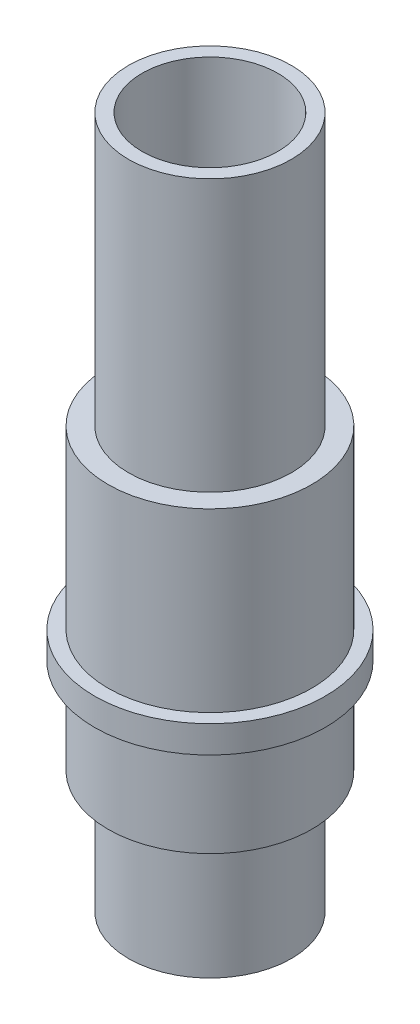
ISO-10303-21;
HEADER;
FILE_DESCRIPTION(('STEP AP214'),'2;1');
FILE_NAME('part.step','',(''),(''),'','','');
FILE_SCHEMA(('AUTOMOTIVE_DESIGN { 1 0 10303 214 1 1 1 1 }'));
ENDSEC;
DATA;
#1=APPLICATION_CONTEXT('core data for automotive mechanical design processes');
#2=APPLICATION_PROTOCOL_DEFINITION('international standard','automotive_design',2000,#1);
#3=PRODUCT_CONTEXT('',#1,'mechanical');
#4=PRODUCT('Part','Part','',(#3));
#5=PRODUCT_RELATED_PRODUCT_CATEGORY('part','',(#4));
#6=PRODUCT_DEFINITION_FORMATION('','',#4);
#7=PRODUCT_DEFINITION_CONTEXT('part definition',#1,'design');
#8=PRODUCT_DEFINITION('design','',#6,#7);
#9=PRODUCT_DEFINITION_SHAPE('','',#8);
#10=(LENGTH_UNIT() NAMED_UNIT(*) SI_UNIT(.MILLI.,.METRE.));
#11=(NAMED_UNIT(*) PLANE_ANGLE_UNIT() SI_UNIT($,.RADIAN.));
#12=(NAMED_UNIT(*) SI_UNIT($,.STERADIAN.) SOLID_ANGLE_UNIT());
#13=UNCERTAINTY_MEASURE_WITH_UNIT(LENGTH_MEASURE(1.E-05),#10,'distance_accuracy_value','');
#14=(GEOMETRIC_REPRESENTATION_CONTEXT(3) GLOBAL_UNCERTAINTY_ASSIGNED_CONTEXT((#13)) GLOBAL_UNIT_ASSIGNED_CONTEXT((#10,
#11,#12)) REPRESENTATION_CONTEXT('',''));
#15=CARTESIAN_POINT('',(0.,0.,0.));
#16=DIRECTION('',(0.,0.,1.));
#17=DIRECTION('',(1.,0.,0.));
#18=AXIS2_PLACEMENT_3D('',#15,#16,#17);
#19=CARTESIAN_POINT('',(0.,31.,0.));
#20=DIRECTION('',(0.,1.,0.));
#21=DIRECTION('',(0.,0.,1.));
#22=AXIS2_PLACEMENT_3D('',#19,#20,#21);
#23=PLANE('',#22);
#24=CARTESIAN_POINT('',(0.,31.,0.));
#25=DIRECTION('',(0.,1.,0.));
#26=DIRECTION('',(0.,0.,1.));
#27=AXIS2_PLACEMENT_3D('',#24,#25,#26);
#28=CIRCLE('',#27,7.5);
#29=CARTESIAN_POINT('',(0.,31.,7.5));
#30=VERTEX_POINT('',#29);
#31=EDGE_CURVE('E46',#30,#30,#28,.T.);
#32=ORIENTED_EDGE('',*,*,#31,.T.);
#33=EDGE_LOOP('',(#32));
#34=FACE_BOUND('',#33,.T.);
#35=CARTESIAN_POINT('',(0.,31.,0.));
#36=DIRECTION('',(0.,1.,0.));
#37=DIRECTION('',(0.,0.,1.));
#38=AXIS2_PLACEMENT_3D('',#35,#36,#37);
#39=CIRCLE('',#38,6.);
#40=CARTESIAN_POINT('',(0.,31.,6.));
#41=VERTEX_POINT('',#40);
#42=EDGE_CURVE('E123',#41,#41,#39,.T.);
#43=ORIENTED_EDGE('',*,*,#42,.F.);
#44=EDGE_LOOP('',(#43));
#45=FACE_BOUND('',#44,.T.);
#46=ADVANCED_FACE('F31',(#34,#45),#23,.T.);
#47=CARTESIAN_POINT('',(0.,0.,0.));
#48=DIRECTION('',(0.,1.,0.));
#49=DIRECTION('',(0.,0.,1.));
#50=AXIS2_PLACEMENT_3D('',#47,#48,#49);
#51=PLANE('',#50);
#52=CARTESIAN_POINT('',(0.,0.,0.));
#53=DIRECTION('',(0.,1.,0.));
#54=DIRECTION('',(0.,0.,1.));
#55=AXIS2_PLACEMENT_3D('',#52,#53,#54);
#56=CIRCLE('',#55,6.);
#57=CARTESIAN_POINT('',(0.,0.,6.));
#58=VERTEX_POINT('',#57);
#59=EDGE_CURVE('E35',#58,#58,#56,.T.);
#60=ORIENTED_EDGE('',*,*,#59,.F.);
#61=EDGE_LOOP('',(#60));
#62=FACE_BOUND('',#61,.T.);
#63=CARTESIAN_POINT('',(0.,0.,0.));
#64=DIRECTION('',(0.,1.,0.));
#65=DIRECTION('',(0.,0.,1.));
#66=AXIS2_PLACEMENT_3D('',#63,#64,#65);
#67=CIRCLE('',#66,5.);
#68=CARTESIAN_POINT('',(0.,0.,5.));
#69=VERTEX_POINT('',#68);
#70=EDGE_CURVE('E58',#69,#69,#67,.T.);
#71=ORIENTED_EDGE('',*,*,#70,.T.);
#72=EDGE_LOOP('',(#71));
#73=FACE_BOUND('',#72,.T.);
#74=ADVANCED_FACE('F68',(#62,#73),#51,.F.);
#75=CARTESIAN_POINT('',(0.,9.,0.));
#76=DIRECTION('',(0.,-1.,0.));
#77=DIRECTION('',(0.,0.,-1.));
#78=AXIS2_PLACEMENT_3D('',#75,#76,#77);
#79=CYLINDRICAL_SURFACE('',#78,6.);
#80=CARTESIAN_POINT('',(0.,9.,0.));
#81=DIRECTION('',(0.,1.,0.));
#82=DIRECTION('',(0.,0.,1.));
#83=AXIS2_PLACEMENT_3D('',#80,#81,#82);
#84=CIRCLE('',#83,6.);
#85=CARTESIAN_POINT('',(0.,9.,6.));
#86=VERTEX_POINT('',#85);
#87=EDGE_CURVE('E39',#86,#86,#84,.T.);
#88=ORIENTED_EDGE('',*,*,#87,.F.);
#89=EDGE_LOOP('',(#88));
#90=FACE_BOUND('',#89,.T.);
#91=ORIENTED_EDGE('',*,*,#59,.T.);
#92=EDGE_LOOP('',(#91));
#93=FACE_BOUND('',#92,.T.);
#94=ADVANCED_FACE('F33',(#90,#93),#79,.T.);
#95=CARTESIAN_POINT('',(0.,9.,0.));
#96=DIRECTION('',(0.,-1.,0.));
#97=DIRECTION('',(0.,0.,-1.));
#98=AXIS2_PLACEMENT_3D('',#95,#96,#97);
#99=CYLINDRICAL_SURFACE('',#98,5.);
#100=ORIENTED_EDGE('',*,*,#70,.F.);
#101=EDGE_LOOP('',(#100));
#102=FACE_BOUND('',#101,.T.);
#103=CARTESIAN_POINT('',(0.,51.,0.));
#104=DIRECTION('',(0.,1.,0.));
#105=DIRECTION('',(0.,0.,1.));
#106=AXIS2_PLACEMENT_3D('',#103,#104,#105);
#107=CIRCLE('',#106,5.);
#108=CARTESIAN_POINT('',(0.,51.,5.));
#109=VERTEX_POINT('',#108);
#110=EDGE_CURVE('E121',#109,#109,#107,.T.);
#111=ORIENTED_EDGE('',*,*,#110,.T.);
#112=EDGE_LOOP('',(#111));
#113=FACE_BOUND('',#112,.T.);
#114=ADVANCED_FACE('F74',(#102,#113),#99,.F.);
#115=CARTESIAN_POINT('',(0.,9.,0.));
#116=DIRECTION('',(0.,1.,0.));
#117=DIRECTION('',(0.,0.,1.));
#118=AXIS2_PLACEMENT_3D('',#115,#116,#117);
#119=PLANE('',#118);
#120=ORIENTED_EDGE('',*,*,#87,.T.);
#121=EDGE_LOOP('',(#120));
#122=FACE_BOUND('',#121,.T.);
#123=CARTESIAN_POINT('',(0.,9.,0.));
#124=DIRECTION('',(0.,1.,0.));
#125=DIRECTION('',(0.,0.,1.));
#126=AXIS2_PLACEMENT_3D('',#123,#124,#125);
#127=CIRCLE('',#126,7.5);
#128=CARTESIAN_POINT('',(0.,9.,7.5));
#129=VERTEX_POINT('',#128);
#130=EDGE_CURVE('E51',#129,#129,#127,.T.);
#131=ORIENTED_EDGE('',*,*,#130,.F.);
#132=EDGE_LOOP('',(#131));
#133=FACE_BOUND('',#132,.T.);
#134=ADVANCED_FACE('F81',(#122,#133),#119,.F.);
#135=CARTESIAN_POINT('',(0.,16.,0.));
#136=DIRECTION('',(0.,-1.,0.));
#137=DIRECTION('',(0.,0.,-1.));
#138=AXIS2_PLACEMENT_3D('',#135,#136,#137);
#139=CYLINDRICAL_SURFACE('',#138,7.5);
#140=CARTESIAN_POINT('',(0.,16.,0.));
#141=DIRECTION('',(0.,1.,0.));
#142=DIRECTION('',(0.,0.,1.));
#143=AXIS2_PLACEMENT_3D('',#140,#141,#142);
#144=CIRCLE('',#143,7.5);
#145=CARTESIAN_POINT('',(0.,16.,7.5));
#146=VERTEX_POINT('',#145);
#147=EDGE_CURVE('E55',#146,#146,#144,.T.);
#148=ORIENTED_EDGE('',*,*,#147,.F.);
#149=EDGE_LOOP('',(#148));
#150=FACE_BOUND('',#149,.T.);
#151=ORIENTED_EDGE('',*,*,#130,.T.);
#152=EDGE_LOOP('',(#151));
#153=FACE_BOUND('',#152,.T.);
#154=ADVANCED_FACE('F83',(#150,#153),#139,.T.);
#155=CARTESIAN_POINT('',(0.,18.,0.));
#156=DIRECTION('',(0.,1.,0.));
#157=DIRECTION('',(0.,0.,1.));
#158=AXIS2_PLACEMENT_3D('',#155,#156,#157);
#159=PLANE('',#158);
#160=CARTESIAN_POINT('',(0.,18.,0.));
#161=DIRECTION('',(0.,1.,0.));
#162=DIRECTION('',(0.,0.,1.));
#163=AXIS2_PLACEMENT_3D('',#160,#161,#162);
#164=CIRCLE('',#163,7.5);
#165=CARTESIAN_POINT('',(0.,18.,7.5));
#166=VERTEX_POINT('',#165);
#167=EDGE_CURVE('E10',#166,#166,#164,.T.);
#168=ORIENTED_EDGE('',*,*,#167,.F.);
#169=EDGE_LOOP('',(#168));
#170=FACE_BOUND('',#169,.T.);
#171=CARTESIAN_POINT('',(0.,18.,0.));
#172=DIRECTION('',(0.,1.,0.));
#173=DIRECTION('',(0.,0.,1.));
#174=AXIS2_PLACEMENT_3D('',#171,#172,#173);
#175=CIRCLE('',#174,8.5);
#176=CARTESIAN_POINT('',(0.,18.,8.5));
#177=VERTEX_POINT('',#176);
#178=EDGE_CURVE('E48',#177,#177,#175,.T.);
#179=ORIENTED_EDGE('',*,*,#178,.T.);
#180=EDGE_LOOP('',(#179));
#181=FACE_BOUND('',#180,.T.);
#182=ADVANCED_FACE('F86',(#170,#181),#159,.T.);
#183=CARTESIAN_POINT('',(0.,16.,0.));
#184=DIRECTION('',(0.,1.,0.));
#185=DIRECTION('',(0.,0.,1.));
#186=AXIS2_PLACEMENT_3D('',#183,#184,#185);
#187=PLANE('',#186);
#188=ORIENTED_EDGE('',*,*,#147,.T.);
#189=EDGE_LOOP('',(#188));
#190=FACE_BOUND('',#189,.T.);
#191=CARTESIAN_POINT('',(0.,16.,0.));
#192=DIRECTION('',(0.,1.,0.));
#193=DIRECTION('',(0.,0.,1.));
#194=AXIS2_PLACEMENT_3D('',#191,#192,#193);
#195=CIRCLE('',#194,8.5);
#196=CARTESIAN_POINT('',(0.,16.,8.5));
#197=VERTEX_POINT('',#196);
#198=EDGE_CURVE('E52',#197,#197,#195,.T.);
#199=ORIENTED_EDGE('',*,*,#198,.F.);
#200=EDGE_LOOP('',(#199));
#201=FACE_BOUND('',#200,.T.);
#202=ADVANCED_FACE('F95',(#190,#201),#187,.F.);
#203=CARTESIAN_POINT('',(0.,18.,0.));
#204=DIRECTION('',(0.,-1.,0.));
#205=DIRECTION('',(0.,0.,-1.));
#206=AXIS2_PLACEMENT_3D('',#203,#204,#205);
#207=CYLINDRICAL_SURFACE('',#206,8.5);
#208=ORIENTED_EDGE('',*,*,#178,.F.);
#209=EDGE_LOOP('',(#208));
#210=FACE_BOUND('',#209,.T.);
#211=ORIENTED_EDGE('',*,*,#198,.T.);
#212=EDGE_LOOP('',(#211));
#213=FACE_BOUND('',#212,.T.);
#214=ADVANCED_FACE('F91',(#210,#213),#207,.T.);
#215=CARTESIAN_POINT('',(0.,31.,0.));
#216=DIRECTION('',(0.,-1.,0.));
#217=DIRECTION('',(0.,0.,-1.));
#218=AXIS2_PLACEMENT_3D('',#215,#216,#217);
#219=CYLINDRICAL_SURFACE('',#218,7.5);
#220=ORIENTED_EDGE('',*,*,#31,.F.);
#221=EDGE_LOOP('',(#220));
#222=FACE_BOUND('',#221,.T.);
#223=ORIENTED_EDGE('',*,*,#167,.T.);
#224=EDGE_LOOP('',(#223));
#225=FACE_BOUND('',#224,.T.);
#226=ADVANCED_FACE('F94',(#222,#225),#219,.T.);
#227=CARTESIAN_POINT('',(0.,51.,0.));
#228=DIRECTION('',(0.,1.,0.));
#229=DIRECTION('',(0.,0.,1.));
#230=AXIS2_PLACEMENT_3D('',#227,#228,#229);
#231=PLANE('',#230);
#232=CARTESIAN_POINT('',(0.,51.,0.));
#233=DIRECTION('',(0.,1.,0.));
#234=DIRECTION('',(0.,0.,1.));
#235=AXIS2_PLACEMENT_3D('',#232,#233,#234);
#236=CIRCLE('',#235,6.);
#237=CARTESIAN_POINT('',(0.,51.,6.));
#238=VERTEX_POINT('',#237);
#239=EDGE_CURVE('E118',#238,#238,#236,.T.);
#240=ORIENTED_EDGE('',*,*,#239,.T.);
#241=EDGE_LOOP('',(#240));
#242=FACE_BOUND('',#241,.T.);
#243=ORIENTED_EDGE('',*,*,#110,.F.);
#244=EDGE_LOOP('',(#243));
#245=FACE_BOUND('',#244,.T.);
#246=ADVANCED_FACE('F104',(#242,#245),#231,.T.);
#247=CARTESIAN_POINT('',(0.,51.,0.));
#248=DIRECTION('',(0.,-1.,0.));
#249=DIRECTION('',(0.,0.,-1.));
#250=AXIS2_PLACEMENT_3D('',#247,#248,#249);
#251=CYLINDRICAL_SURFACE('',#250,6.);
#252=ORIENTED_EDGE('',*,*,#239,.F.);
#253=EDGE_LOOP('',(#252));
#254=FACE_BOUND('',#253,.T.);
#255=ORIENTED_EDGE('',*,*,#42,.T.);
#256=EDGE_LOOP('',(#255));
#257=FACE_BOUND('',#256,.T.);
#258=ADVANCED_FACE('F107',(#254,#257),#251,.T.);
#259=CLOSED_SHELL('',(#46,#74,#94,#114,#134,#154,#182,#202,#214,#226,#246,#258));
#260=MANIFOLD_SOLID_BREP('B2',#259);
#261=ADVANCED_BREP_SHAPE_REPRESENTATION('',(#18,#260),#14);
#262=SHAPE_DEFINITION_REPRESENTATION(#9,#261);
ENDSEC;
END-ISO-10303-21;
